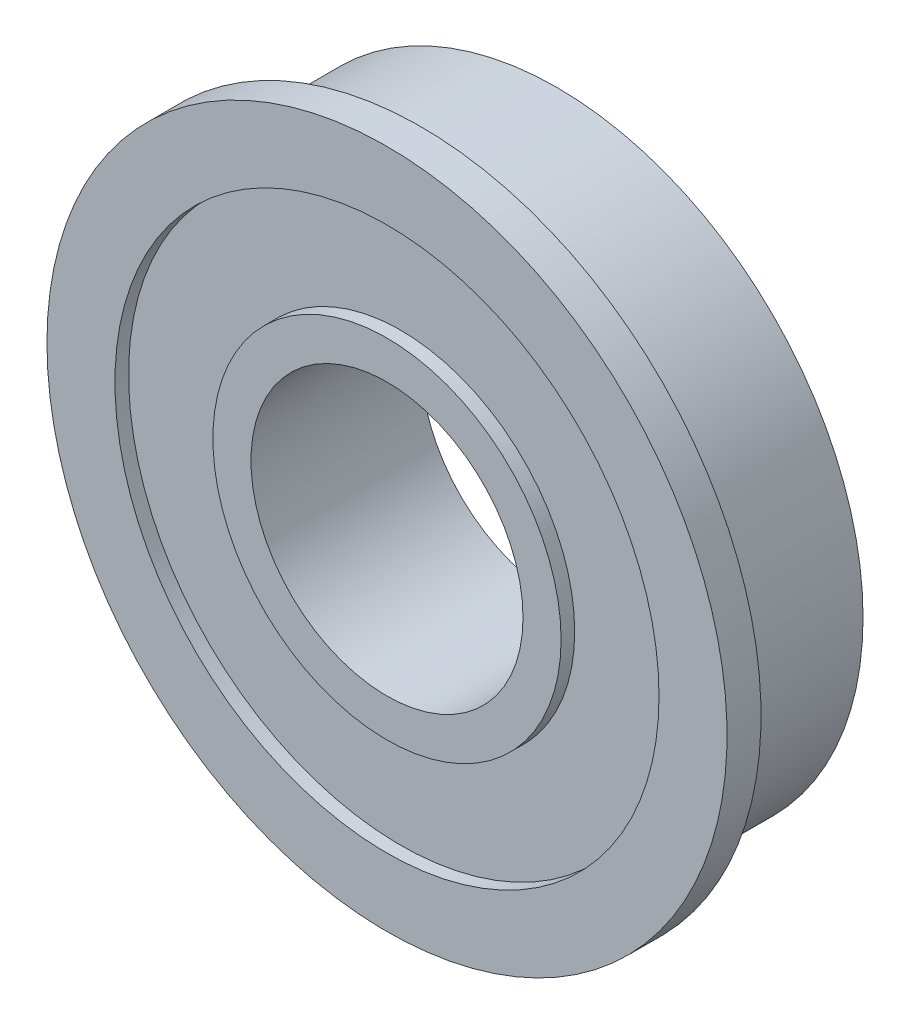
ISO-10303-21;
HEADER;
FILE_DESCRIPTION(('STEP AP214'),'2;1');
FILE_NAME('part.step','',(''),(''),'','','');
FILE_SCHEMA(('AUTOMOTIVE_DESIGN { 1 0 10303 214 1 1 1 1 }'));
ENDSEC;
DATA;
#1=APPLICATION_CONTEXT('core data for automotive mechanical design processes');
#2=APPLICATION_PROTOCOL_DEFINITION('international standard','automotive_design',2000,#1);
#3=PRODUCT_CONTEXT('',#1,'mechanical');
#4=PRODUCT('Part','Part','',(#3));
#5=PRODUCT_RELATED_PRODUCT_CATEGORY('part','',(#4));
#6=PRODUCT_DEFINITION_FORMATION('','',#4);
#7=PRODUCT_DEFINITION_CONTEXT('part definition',#1,'design');
#8=PRODUCT_DEFINITION('design','',#6,#7);
#9=PRODUCT_DEFINITION_SHAPE('','',#8);
#10=(LENGTH_UNIT() NAMED_UNIT(*) SI_UNIT(.MILLI.,.METRE.));
#11=(NAMED_UNIT(*) PLANE_ANGLE_UNIT() SI_UNIT($,.RADIAN.));
#12=(NAMED_UNIT(*) SI_UNIT($,.STERADIAN.) SOLID_ANGLE_UNIT());
#13=UNCERTAINTY_MEASURE_WITH_UNIT(LENGTH_MEASURE(1.E-05),#10,'distance_accuracy_value','');
#14=(GEOMETRIC_REPRESENTATION_CONTEXT(3) GLOBAL_UNCERTAINTY_ASSIGNED_CONTEXT((#13)) GLOBAL_UNIT_ASSIGNED_CONTEXT((#10,
#11,#12)) REPRESENTATION_CONTEXT('',''));
#15=CARTESIAN_POINT('',(0.,0.,0.));
#16=DIRECTION('',(0.,0.,1.));
#17=DIRECTION('',(1.,0.,0.));
#18=AXIS2_PLACEMENT_3D('',#15,#16,#17);
#19=CARTESIAN_POINT('',(0.738909090909091,0.,3.96875));
#20=DIRECTION('',(0.,0.,1.));
#21=DIRECTION('',(1.,0.,0.));
#22=AXIS2_PLACEMENT_3D('',#19,#20,#21);
#23=PLANE('',#22);
#24=CARTESIAN_POINT('',(0.,0.,3.96875));
#25=DIRECTION('',(0.,0.,1.));
#26=DIRECTION('',(1.,0.,0.));
#27=AXIS2_PLACEMENT_3D('',#24,#25,#26);
#28=CIRCLE('',#27,8.128);
#29=CARTESIAN_POINT('',(8.128,0.,3.96875));
#30=VERTEX_POINT('',#29);
#31=EDGE_CURVE('E18',#30,#30,#28,.F.);
#32=ORIENTED_EDGE('',*,*,#31,.F.);
#33=EDGE_LOOP('',(#32));
#34=FACE_BOUND('',#33,.T.);
#35=CARTESIAN_POINT('',(0.,0.,3.96875));
#36=DIRECTION('',(0.,0.,1.));
#37=DIRECTION('',(1.,0.,0.));
#38=AXIS2_PLACEMENT_3D('',#35,#36,#37);
#39=CIRCLE('',#38,6.35);
#40=CARTESIAN_POINT('',(6.35,0.,3.96875));
#41=VERTEX_POINT('',#40);
#42=EDGE_CURVE('E58',#41,#41,#39,.F.);
#43=ORIENTED_EDGE('',*,*,#42,.T.);
#44=EDGE_LOOP('',(#43));
#45=FACE_BOUND('',#44,.T.);
#46=ADVANCED_FACE('F15',(#34,#45),#23,.T.);
#47=CARTESIAN_POINT('',(0.,0.,0.));
#48=DIRECTION('',(0.,0.,1.));
#49=DIRECTION('',(1.,0.,0.));
#50=AXIS2_PLACEMENT_3D('',#47,#48,#49);
#51=CYLINDRICAL_SURFACE('',#50,8.128);
#52=CARTESIAN_POINT('',(0.,0.,3.33375));
#53=DIRECTION('',(0.,0.,1.));
#54=DIRECTION('',(1.,0.,0.));
#55=AXIS2_PLACEMENT_3D('',#52,#53,#54);
#56=CIRCLE('',#55,8.128);
#57=CARTESIAN_POINT('',(8.128,0.,3.33375));
#58=VERTEX_POINT('',#57);
#59=EDGE_CURVE('E56',#58,#58,#56,.F.);
#60=ORIENTED_EDGE('',*,*,#59,.F.);
#61=EDGE_LOOP('',(#60));
#62=FACE_BOUND('',#61,.T.);
#63=ORIENTED_EDGE('',*,*,#31,.T.);
#64=EDGE_LOOP('',(#63));
#65=FACE_BOUND('',#64,.T.);
#66=ADVANCED_FACE('F65',(#62,#65),#51,.T.);
#67=CARTESIAN_POINT('',(0.,0.,0.));
#68=DIRECTION('',(0.,0.,1.));
#69=DIRECTION('',(1.,0.,0.));
#70=AXIS2_PLACEMENT_3D('',#67,#68,#69);
#71=CYLINDRICAL_SURFACE('',#70,6.35);
#72=ORIENTED_EDGE('',*,*,#42,.F.);
#73=EDGE_LOOP('',(#72));
#74=FACE_BOUND('',#73,.T.);
#75=CARTESIAN_POINT('',(0.,0.,-3.96875));
#76=DIRECTION('',(0.,0.,1.));
#77=DIRECTION('',(1.,0.,0.));
#78=AXIS2_PLACEMENT_3D('',#75,#76,#77);
#79=CIRCLE('',#78,6.35);
#80=CARTESIAN_POINT('',(6.35,0.,-3.96875));
#81=VERTEX_POINT('',#80);
#82=EDGE_CURVE('E53',#81,#81,#79,.F.);
#83=ORIENTED_EDGE('',*,*,#82,.T.);
#84=EDGE_LOOP('',(#83));
#85=FACE_BOUND('',#84,.T.);
#86=ADVANCED_FACE('F72',(#74,#85),#71,.F.);
#87=CARTESIAN_POINT('',(1.15454545454546,0.,3.33375));
#88=DIRECTION('',(0.,0.,1.));
#89=DIRECTION('',(1.,0.,0.));
#90=AXIS2_PLACEMENT_3D('',#87,#88,#89);
#91=PLANE('',#90);
#92=CARTESIAN_POINT('',(0.,0.,3.33375));
#93=DIRECTION('',(0.,0.,1.));
#94=DIRECTION('',(1.,0.,0.));
#95=AXIS2_PLACEMENT_3D('',#92,#93,#94);
#96=CIRCLE('',#95,12.7);
#97=CARTESIAN_POINT('',(12.7,0.,3.33375));
#98=VERTEX_POINT('',#97);
#99=EDGE_CURVE('E50',#98,#98,#96,.T.);
#100=ORIENTED_EDGE('',*,*,#99,.T.);
#101=EDGE_LOOP('',(#100));
#102=FACE_BOUND('',#101,.T.);
#103=ORIENTED_EDGE('',*,*,#59,.T.);
#104=EDGE_LOOP('',(#103));
#105=FACE_BOUND('',#104,.T.);
#106=ADVANCED_FACE('F116',(#102,#105),#91,.T.);
#107=CARTESIAN_POINT('',(0.738909090909091,0.,-3.96875));
#108=DIRECTION('',(0.,0.,1.));
#109=DIRECTION('',(1.,0.,0.));
#110=AXIS2_PLACEMENT_3D('',#107,#108,#109);
#111=PLANE('',#110);
#112=CARTESIAN_POINT('',(0.,0.,-3.96875));
#113=DIRECTION('',(0.,0.,1.));
#114=DIRECTION('',(1.,0.,0.));
#115=AXIS2_PLACEMENT_3D('',#112,#113,#114);
#116=CIRCLE('',#115,8.128);
#117=CARTESIAN_POINT('',(8.128,0.,-3.96875));
#118=VERTEX_POINT('',#117);
#119=EDGE_CURVE('E47',#118,#118,#116,.T.);
#120=ORIENTED_EDGE('',*,*,#119,.F.);
#121=EDGE_LOOP('',(#120));
#122=FACE_BOUND('',#121,.T.);
#123=ORIENTED_EDGE('',*,*,#82,.F.);
#124=EDGE_LOOP('',(#123));
#125=FACE_BOUND('',#124,.T.);
#126=ADVANCED_FACE('F112',(#122,#125),#111,.F.);
#127=CARTESIAN_POINT('',(0.,0.,0.));
#128=DIRECTION('',(0.,0.,1.));
#129=DIRECTION('',(1.,0.,0.));
#130=AXIS2_PLACEMENT_3D('',#127,#128,#129);
#131=CYLINDRICAL_SURFACE('',#130,12.7);
#132=ORIENTED_EDGE('',*,*,#99,.F.);
#133=EDGE_LOOP('',(#132));
#134=FACE_BOUND('',#133,.T.);
#135=CARTESIAN_POINT('',(0.,0.,3.96875));
#136=DIRECTION('',(0.,0.,1.));
#137=DIRECTION('',(1.,0.,0.));
#138=AXIS2_PLACEMENT_3D('',#135,#136,#137);
#139=CIRCLE('',#138,12.7);
#140=CARTESIAN_POINT('',(12.7,0.,3.96875));
#141=VERTEX_POINT('',#140);
#142=EDGE_CURVE('E44',#141,#141,#139,.F.);
#143=ORIENTED_EDGE('',*,*,#142,.F.);
#144=EDGE_LOOP('',(#143));
#145=FACE_BOUND('',#144,.T.);
#146=ADVANCED_FACE('F108',(#134,#145),#131,.F.);
#147=CARTESIAN_POINT('',(0.,0.,0.));
#148=DIRECTION('',(0.,0.,1.));
#149=DIRECTION('',(1.,0.,0.));
#150=AXIS2_PLACEMENT_3D('',#147,#148,#149);
#151=CYLINDRICAL_SURFACE('',#150,8.128);
#152=ORIENTED_EDGE('',*,*,#119,.T.);
#153=EDGE_LOOP('',(#152));
#154=FACE_BOUND('',#153,.T.);
#155=CARTESIAN_POINT('',(0.,0.,-3.33375));
#156=DIRECTION('',(0.,0.,1.));
#157=DIRECTION('',(1.,0.,0.));
#158=AXIS2_PLACEMENT_3D('',#155,#156,#157);
#159=CIRCLE('',#158,8.128);
#160=CARTESIAN_POINT('',(8.128,0.,-3.33375));
#161=VERTEX_POINT('',#160);
#162=EDGE_CURVE('E41',#161,#161,#159,.F.);
#163=ORIENTED_EDGE('',*,*,#162,.T.);
#164=EDGE_LOOP('',(#163));
#165=FACE_BOUND('',#164,.T.);
#166=ADVANCED_FACE('F104',(#154,#165),#151,.T.);
#167=CARTESIAN_POINT('',(1.29886363636364,0.,3.96875));
#168=DIRECTION('',(0.,0.,1.));
#169=DIRECTION('',(1.,0.,0.));
#170=AXIS2_PLACEMENT_3D('',#167,#168,#169);
#171=PLANE('',#170);
#172=ORIENTED_EDGE('',*,*,#142,.T.);
#173=EDGE_LOOP('',(#172));
#174=FACE_BOUND('',#173,.T.);
#175=CARTESIAN_POINT('',(0.,0.,3.96875));
#176=DIRECTION('',(0.,0.,-1.));
#177=DIRECTION('',(-1.,0.,0.));
#178=AXIS2_PLACEMENT_3D('',#175,#176,#177);
#179=CIRCLE('',#178,15.875);
#180=CARTESIAN_POINT('',(-15.875,0.,3.96875));
#181=VERTEX_POINT('',#180);
#182=EDGE_CURVE('E38',#181,#181,#179,.T.);
#183=ORIENTED_EDGE('',*,*,#182,.F.);
#184=EDGE_LOOP('',(#183));
#185=FACE_BOUND('',#184,.T.);
#186=ADVANCED_FACE('F100',(#174,#185),#171,.T.);
#187=CARTESIAN_POINT('',(1.15454545454546,0.,-3.33375));
#188=DIRECTION('',(0.,0.,1.));
#189=DIRECTION('',(1.,0.,0.));
#190=AXIS2_PLACEMENT_3D('',#187,#188,#189);
#191=PLANE('',#190);
#192=CARTESIAN_POINT('',(0.,0.,-3.33375));
#193=DIRECTION('',(0.,0.,1.));
#194=DIRECTION('',(1.,0.,0.));
#195=AXIS2_PLACEMENT_3D('',#192,#193,#194);
#196=CIRCLE('',#195,12.7);
#197=CARTESIAN_POINT('',(12.7,0.,-3.33375));
#198=VERTEX_POINT('',#197);
#199=EDGE_CURVE('E35',#198,#198,#196,.F.);
#200=ORIENTED_EDGE('',*,*,#199,.T.);
#201=EDGE_LOOP('',(#200));
#202=FACE_BOUND('',#201,.T.);
#203=ORIENTED_EDGE('',*,*,#162,.F.);
#204=EDGE_LOOP('',(#203));
#205=FACE_BOUND('',#204,.T.);
#206=ADVANCED_FACE('F96',(#202,#205),#191,.F.);
#207=CARTESIAN_POINT('',(0.,0.,3.96875));
#208=DIRECTION('',(0.,0.,-1.));
#209=DIRECTION('',(-1.,0.,0.));
#210=AXIS2_PLACEMENT_3D('',#207,#208,#209);
#211=CYLINDRICAL_SURFACE('',#210,15.875);
#212=ORIENTED_EDGE('',*,*,#182,.T.);
#213=EDGE_LOOP('',(#212));
#214=FACE_BOUND('',#213,.T.);
#215=CARTESIAN_POINT('',(0.,0.,2.38125));
#216=DIRECTION('',(0.,0.,-1.));
#217=DIRECTION('',(-1.,0.,0.));
#218=AXIS2_PLACEMENT_3D('',#215,#216,#217);
#219=CIRCLE('',#218,15.875);
#220=CARTESIAN_POINT('',(-15.875,0.,2.38125));
#221=VERTEX_POINT('',#220);
#222=EDGE_CURVE('E32',#221,#221,#219,.F.);
#223=ORIENTED_EDGE('',*,*,#222,.T.);
#224=EDGE_LOOP('',(#223));
#225=FACE_BOUND('',#224,.T.);
#226=ADVANCED_FACE('F92',(#214,#225),#211,.T.);
#227=CARTESIAN_POINT('',(0.,0.,0.));
#228=DIRECTION('',(0.,0.,1.));
#229=DIRECTION('',(1.,0.,0.));
#230=AXIS2_PLACEMENT_3D('',#227,#228,#229);
#231=CYLINDRICAL_SURFACE('',#230,12.7);
#232=ORIENTED_EDGE('',*,*,#199,.F.);
#233=EDGE_LOOP('',(#232));
#234=FACE_BOUND('',#233,.T.);
#235=CARTESIAN_POINT('',(0.,0.,-3.96875));
#236=DIRECTION('',(0.,0.,1.));
#237=DIRECTION('',(1.,0.,0.));
#238=AXIS2_PLACEMENT_3D('',#235,#236,#237);
#239=CIRCLE('',#238,12.7);
#240=CARTESIAN_POINT('',(12.7,0.,-3.96875));
#241=VERTEX_POINT('',#240);
#242=EDGE_CURVE('E27',#241,#241,#239,.F.);
#243=ORIENTED_EDGE('',*,*,#242,.T.);
#244=EDGE_LOOP('',(#243));
#245=FACE_BOUND('',#244,.T.);
#246=ADVANCED_FACE('F88',(#234,#245),#231,.F.);
#247=CARTESIAN_POINT('',(1.44318181818182,0.,2.38125));
#248=DIRECTION('',(0.,0.,1.));
#249=DIRECTION('',(0.,-1.,0.));
#250=AXIS2_PLACEMENT_3D('',#247,#248,#249);
#251=PLANE('',#250);
#252=ORIENTED_EDGE('',*,*,#222,.F.);
#253=EDGE_LOOP('',(#252));
#254=FACE_BOUND('',#253,.T.);
#255=CARTESIAN_POINT('',(0.,0.,2.38125));
#256=DIRECTION('',(0.,0.,1.));
#257=DIRECTION('',(1.,0.,0.));
#258=AXIS2_PLACEMENT_3D('',#255,#256,#257);
#259=CIRCLE('',#258,14.2875);
#260=CARTESIAN_POINT('',(14.2875,0.,2.38125));
#261=VERTEX_POINT('',#260);
#262=EDGE_CURVE('E22',#261,#261,#259,.F.);
#263=ORIENTED_EDGE('',*,*,#262,.F.);
#264=EDGE_LOOP('',(#263));
#265=FACE_BOUND('',#264,.T.);
#266=ADVANCED_FACE('F81',(#254,#265),#251,.F.);
#267=CARTESIAN_POINT('',(1.29886363636364,0.,-3.96875));
#268=DIRECTION('',(0.,0.,1.));
#269=DIRECTION('',(1.,0.,0.));
#270=AXIS2_PLACEMENT_3D('',#267,#268,#269);
#271=PLANE('',#270);
#272=CARTESIAN_POINT('',(0.,0.,-3.96875));
#273=DIRECTION('',(0.,0.,1.));
#274=DIRECTION('',(1.,0.,0.));
#275=AXIS2_PLACEMENT_3D('',#272,#273,#274);
#276=CIRCLE('',#275,14.2875);
#277=CARTESIAN_POINT('',(14.2875,0.,-3.96875));
#278=VERTEX_POINT('',#277);
#279=EDGE_CURVE('E10',#278,#278,#276,.T.);
#280=ORIENTED_EDGE('',*,*,#279,.F.);
#281=EDGE_LOOP('',(#280));
#282=FACE_BOUND('',#281,.T.);
#283=ORIENTED_EDGE('',*,*,#242,.F.);
#284=EDGE_LOOP('',(#283));
#285=FACE_BOUND('',#284,.T.);
#286=ADVANCED_FACE('F76',(#282,#285),#271,.F.);
#287=CARTESIAN_POINT('',(0.,0.,0.));
#288=DIRECTION('',(0.,0.,1.));
#289=DIRECTION('',(1.,0.,0.));
#290=AXIS2_PLACEMENT_3D('',#287,#288,#289);
#291=CYLINDRICAL_SURFACE('',#290,14.2875);
#292=ORIENTED_EDGE('',*,*,#279,.T.);
#293=EDGE_LOOP('',(#292));
#294=FACE_BOUND('',#293,.T.);
#295=ORIENTED_EDGE('',*,*,#262,.T.);
#296=EDGE_LOOP('',(#295));
#297=FACE_BOUND('',#296,.T.);
#298=ADVANCED_FACE('F74',(#294,#297),#291,.T.);
#299=CLOSED_SHELL('',(#46,#66,#86,#106,#126,#146,#166,#186,#206,#226,#246,#266,#286,#298));
#300=MANIFOLD_SOLID_BREP('B1',#299);
#301=ADVANCED_BREP_SHAPE_REPRESENTATION('',(#18,#300),#14);
#302=SHAPE_DEFINITION_REPRESENTATION(#9,#301);
ENDSEC;
END-ISO-10303-21;
